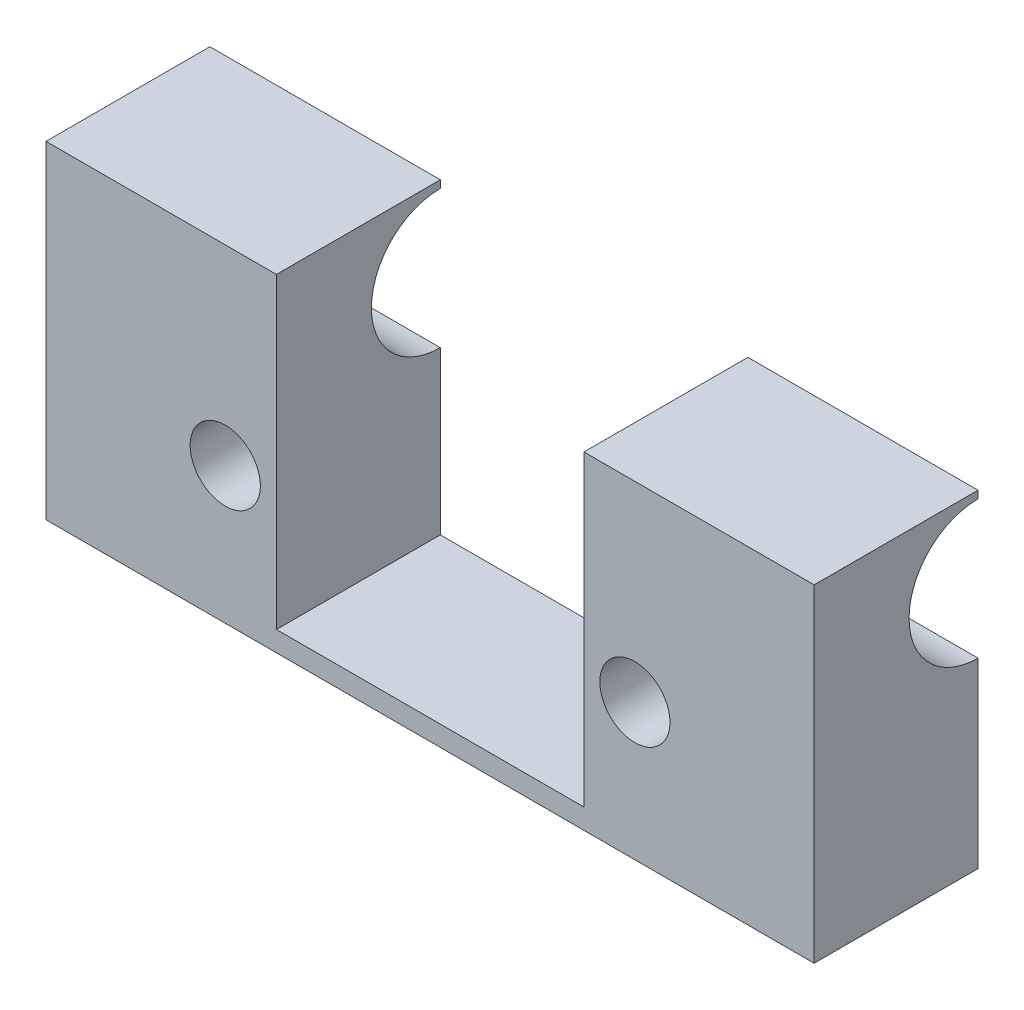
ISO-10303-21;
HEADER;
FILE_DESCRIPTION(('STEP AP214'),'2;1');
FILE_NAME('part.step','',(''),(''),'','','');
FILE_SCHEMA(('AUTOMOTIVE_DESIGN { 1 0 10303 214 1 1 1 1 }'));
ENDSEC;
DATA;
#1=APPLICATION_CONTEXT('core data for automotive mechanical design processes');
#2=APPLICATION_PROTOCOL_DEFINITION('international standard','automotive_design',2000,#1);
#3=PRODUCT_CONTEXT('',#1,'mechanical');
#4=PRODUCT('Part','Part','',(#3));
#5=PRODUCT_RELATED_PRODUCT_CATEGORY('part','',(#4));
#6=PRODUCT_DEFINITION_FORMATION('','',#4);
#7=PRODUCT_DEFINITION_CONTEXT('part definition',#1,'design');
#8=PRODUCT_DEFINITION('design','',#6,#7);
#9=PRODUCT_DEFINITION_SHAPE('','',#8);
#10=(LENGTH_UNIT() NAMED_UNIT(*) SI_UNIT(.MILLI.,.METRE.));
#11=(NAMED_UNIT(*) PLANE_ANGLE_UNIT() SI_UNIT($,.RADIAN.));
#12=(NAMED_UNIT(*) SI_UNIT($,.STERADIAN.) SOLID_ANGLE_UNIT());
#13=UNCERTAINTY_MEASURE_WITH_UNIT(LENGTH_MEASURE(1.E-05),#10,'distance_accuracy_value','');
#14=(GEOMETRIC_REPRESENTATION_CONTEXT(3) GLOBAL_UNCERTAINTY_ASSIGNED_CONTEXT((#13)) GLOBAL_UNIT_ASSIGNED_CONTEXT((#10,
#11,#12)) REPRESENTATION_CONTEXT('',''));
#15=CARTESIAN_POINT('',(0.,0.,0.));
#16=DIRECTION('',(0.,0.,1.));
#17=DIRECTION('',(1.,0.,0.));
#18=AXIS2_PLACEMENT_3D('',#15,#16,#17);
#19=CARTESIAN_POINT('',(0.,0.,0.));
#20=DIRECTION('',(0.,0.,1.));
#21=DIRECTION('',(1.,0.,0.));
#22=AXIS2_PLACEMENT_3D('',#19,#20,#21);
#23=PLANE('',#22);
#24=DIRECTION('',(0.,-1.,0.));
#25=VECTOR('',#24,1.);
#26=CARTESIAN_POINT('',(35.71875,0.,0.));
#27=LINE('',#26,#25);
#28=CARTESIAN_POINT('',(35.71875,30.48,0.));
#29=VERTEX_POINT('',#28);
#30=CARTESIAN_POINT('',(35.71875,29.7794062900681,0.));
#31=VERTEX_POINT('',#30);
#32=EDGE_CURVE('E193',#29,#31,#27,.T.);
#33=ORIENTED_EDGE('',*,*,#32,.T.);
#34=DIRECTION('',(1.,0.,0.));
#35=VECTOR('',#34,1.);
#36=CARTESIAN_POINT('',(-38.4492499999999,29.7794062900681,0.));
#37=LINE('',#36,#35);
#38=CARTESIAN_POINT('',(14.3129,29.7794062900681,0.));
#39=VERTEX_POINT('',#38);
#40=EDGE_CURVE('E207',#39,#31,#37,.T.);
#41=ORIENTED_EDGE('',*,*,#40,.F.);
#42=DIRECTION('',(0.,-1.,0.));
#43=VECTOR('',#42,1.);
#44=CARTESIAN_POINT('',(14.3129,30.48,0.));
#45=LINE('',#44,#43);
#46=CARTESIAN_POINT('',(14.3129,30.48,0.));
#47=VERTEX_POINT('',#46);
#48=EDGE_CURVE('E209',#47,#39,#45,.T.);
#49=ORIENTED_EDGE('',*,*,#48,.F.);
#50=DIRECTION('',(-1.,0.,0.));
#51=VECTOR('',#50,1.);
#52=CARTESIAN_POINT('',(0.,30.48,0.));
#53=LINE('',#52,#51);
#54=EDGE_CURVE('E39',#29,#47,#53,.T.);
#55=ORIENTED_EDGE('',*,*,#54,.F.);
#56=EDGE_LOOP('',(#33,#41,#49,#55));
#57=FACE_BOUND('',#56,.T.);
#58=ADVANCED_FACE('F36',(#57),#23,.F.);
#59=DIRECTION('',(0.,1.,0.));
#60=VECTOR('',#59,1.);
#61=CARTESIAN_POINT('',(-14.2875,30.48,0.));
#62=LINE('',#61,#60);
#63=CARTESIAN_POINT('',(-14.2875,29.7794062900681,0.));
#64=VERTEX_POINT('',#63);
#65=CARTESIAN_POINT('',(-14.2875,30.48,0.));
#66=VERTEX_POINT('',#65);
#67=EDGE_CURVE('E201',#64,#66,#62,.T.);
#68=ORIENTED_EDGE('',*,*,#67,.F.);
#69=DIRECTION('',(1.,0.,0.));
#70=VECTOR('',#69,1.);
#71=CARTESIAN_POINT('',(-38.4492499999999,29.7794062900681,0.));
#72=LINE('',#71,#70);
#73=CARTESIAN_POINT('',(-35.71875,29.7794062900681,0.));
#74=VERTEX_POINT('',#73);
#75=EDGE_CURVE('E196',#74,#64,#72,.T.);
#76=ORIENTED_EDGE('',*,*,#75,.F.);
#77=DIRECTION('',(0.,-1.,0.));
#78=VECTOR('',#77,1.);
#79=CARTESIAN_POINT('',(-35.71875,30.48,0.));
#80=LINE('',#79,#78);
#81=CARTESIAN_POINT('',(-35.71875,30.48,0.));
#82=VERTEX_POINT('',#81);
#83=EDGE_CURVE('E202',#82,#74,#80,.T.);
#84=ORIENTED_EDGE('',*,*,#83,.F.);
#85=DIRECTION('',(-1.,0.,0.));
#86=VECTOR('',#85,1.);
#87=CARTESIAN_POINT('',(0.,30.48,0.));
#88=LINE('',#87,#86);
#89=EDGE_CURVE('E204',#66,#82,#88,.T.);
#90=ORIENTED_EDGE('',*,*,#89,.F.);
#91=EDGE_LOOP('',(#68,#76,#84,#90));
#92=FACE_BOUND('',#91,.T.);
#93=ADVANCED_FACE('F259',(#92),#23,.F.);
#94=CARTESIAN_POINT('',(-19.05,12.7,0.));
#95=DIRECTION('',(0.,0.,1.));
#96=DIRECTION('',(1.,0.,0.));
#97=AXIS2_PLACEMENT_3D('',#94,#95,#96);
#98=CIRCLE('',#97,3.26389999999999);
#99=CARTESIAN_POINT('',(-15.7861,12.7,0.));
#100=VERTEX_POINT('',#99);
#101=EDGE_CURVE('E191',#100,#100,#98,.F.);
#102=ORIENTED_EDGE('',*,*,#101,.F.);
#103=EDGE_LOOP('',(#102));
#104=FACE_BOUND('',#103,.T.);
#105=CARTESIAN_POINT('',(19.05,12.7,0.));
#106=DIRECTION('',(0.,0.,1.));
#107=DIRECTION('',(1.,0.,0.));
#108=AXIS2_PLACEMENT_3D('',#105,#106,#107);
#109=CIRCLE('',#108,3.26389999999999);
#110=CARTESIAN_POINT('',(22.3139,12.7,0.));
#111=VERTEX_POINT('',#110);
#112=EDGE_CURVE('E183',#111,#111,#109,.F.);
#113=ORIENTED_EDGE('',*,*,#112,.F.);
#114=EDGE_LOOP('',(#113));
#115=FACE_BOUND('',#114,.T.);
#116=CARTESIAN_POINT('',(35.71875,16.9565937099319,0.));
#117=VERTEX_POINT('',#116);
#118=CARTESIAN_POINT('',(35.71875,0.,0.));
#119=VERTEX_POINT('',#118);
#120=EDGE_CURVE('E44',#117,#119,#27,.T.);
#121=ORIENTED_EDGE('',*,*,#120,.T.);
#122=DIRECTION('',(-1.,0.,0.));
#123=VECTOR('',#122,1.);
#124=CARTESIAN_POINT('',(0.,0.,0.));
#125=LINE('',#124,#123);
#126=CARTESIAN_POINT('',(-35.71875,0.,0.));
#127=VERTEX_POINT('',#126);
#128=EDGE_CURVE('E11',#119,#127,#125,.T.);
#129=ORIENTED_EDGE('',*,*,#128,.T.);
#130=CARTESIAN_POINT('',(-35.71875,16.9565937099319,0.));
#131=VERTEX_POINT('',#130);
#132=EDGE_CURVE('E58',#131,#127,#80,.T.);
#133=ORIENTED_EDGE('',*,*,#132,.F.);
#134=DIRECTION('',(1.,0.,0.));
#135=VECTOR('',#134,1.);
#136=CARTESIAN_POINT('',(-38.4492499999999,16.9565937099319,0.));
#137=LINE('',#136,#135);
#138=CARTESIAN_POINT('',(-14.2875,16.9565937099319,0.));
#139=VERTEX_POINT('',#138);
#140=EDGE_CURVE('E198',#139,#131,#137,.F.);
#141=ORIENTED_EDGE('',*,*,#140,.F.);
#142=CARTESIAN_POINT('',(-14.2875,1.8796,0.));
#143=VERTEX_POINT('',#142);
#144=EDGE_CURVE('E199',#143,#139,#62,.T.);
#145=ORIENTED_EDGE('',*,*,#144,.F.);
#146=DIRECTION('',(-1.,0.,0.));
#147=VECTOR('',#146,1.);
#148=CARTESIAN_POINT('',(-14.2875,1.8796,0.));
#149=LINE('',#148,#147);
#150=CARTESIAN_POINT('',(14.3129,1.8796,0.));
#151=VERTEX_POINT('',#150);
#152=EDGE_CURVE('E134',#151,#143,#149,.T.);
#153=ORIENTED_EDGE('',*,*,#152,.F.);
#154=CARTESIAN_POINT('',(14.3129,16.9565937099319,0.));
#155=VERTEX_POINT('',#154);
#156=EDGE_CURVE('E210',#155,#151,#45,.T.);
#157=ORIENTED_EDGE('',*,*,#156,.F.);
#158=DIRECTION('',(1.,0.,0.));
#159=VECTOR('',#158,1.);
#160=CARTESIAN_POINT('',(-38.4492499999999,16.9565937099319,0.));
#161=LINE('',#160,#159);
#162=EDGE_CURVE('E212',#117,#155,#161,.F.);
#163=ORIENTED_EDGE('',*,*,#162,.F.);
#164=EDGE_LOOP('',(#121,#129,#133,#141,#145,#153,#157,#163));
#165=FACE_BOUND('',#164,.T.);
#166=ADVANCED_FACE('F246',(#104,#115,#165),#23,.F.);
#167=CARTESIAN_POINT('',(0.,30.48,0.));
#168=DIRECTION('',(0.,-1.,0.));
#169=DIRECTION('',(0.,0.,-1.));
#170=AXIS2_PLACEMENT_3D('',#167,#168,#169);
#171=PLANE('',#170);
#172=DIRECTION('',(0.,0.,-1.));
#173=VECTOR('',#172,1.);
#174=CARTESIAN_POINT('',(-14.2875,30.48,0.));
#175=LINE('',#174,#173);
#176=CARTESIAN_POINT('',(-14.2875,30.48,15.24));
#177=VERTEX_POINT('',#176);
#178=EDGE_CURVE('E145',#177,#66,#175,.T.);
#179=ORIENTED_EDGE('',*,*,#178,.T.);
#180=ORIENTED_EDGE('',*,*,#89,.T.);
#181=DIRECTION('',(0.,0.,1.));
#182=VECTOR('',#181,1.);
#183=CARTESIAN_POINT('',(-35.71875,30.48,15.24));
#184=LINE('',#183,#182);
#185=CARTESIAN_POINT('',(-35.71875,30.48,15.24));
#186=VERTEX_POINT('',#185);
#187=EDGE_CURVE('E163',#82,#186,#184,.T.);
#188=ORIENTED_EDGE('',*,*,#187,.T.);
#189=DIRECTION('',(1.,0.,0.));
#190=VECTOR('',#189,1.);
#191=CARTESIAN_POINT('',(-35.71875,30.48,15.24));
#192=LINE('',#191,#190);
#193=EDGE_CURVE('E167',#186,#177,#192,.T.);
#194=ORIENTED_EDGE('',*,*,#193,.T.);
#195=EDGE_LOOP('',(#179,#180,#188,#194));
#196=FACE_BOUND('',#195,.T.);
#197=ADVANCED_FACE('F257',(#196),#171,.F.);
#198=CARTESIAN_POINT('',(-35.71875,30.48,15.24));
#199=DIRECTION('',(0.,0.,-1.));
#200=DIRECTION('',(-1.,0.,0.));
#201=AXIS2_PLACEMENT_3D('',#198,#199,#200);
#202=PLANE('',#201);
#203=CARTESIAN_POINT('',(19.05,12.7,15.24));
#204=DIRECTION('',(0.,0.,-1.));
#205=DIRECTION('',(-1.,0.,0.));
#206=AXIS2_PLACEMENT_3D('',#203,#204,#205);
#207=CIRCLE('',#206,3.26389999999999);
#208=CARTESIAN_POINT('',(15.7861,12.7,15.24));
#209=VERTEX_POINT('',#208);
#210=EDGE_CURVE('E230',#209,#209,#207,.T.);
#211=ORIENTED_EDGE('',*,*,#210,.T.);
#212=EDGE_LOOP('',(#211));
#213=FACE_BOUND('',#212,.T.);
#214=CARTESIAN_POINT('',(-19.05,12.7,15.24));
#215=DIRECTION('',(0.,0.,-1.));
#216=DIRECTION('',(-1.,0.,0.));
#217=AXIS2_PLACEMENT_3D('',#214,#215,#216);
#218=CIRCLE('',#217,3.26389999999999);
#219=CARTESIAN_POINT('',(-22.3139,12.7,15.24));
#220=VERTEX_POINT('',#219);
#221=EDGE_CURVE('E227',#220,#220,#218,.T.);
#222=ORIENTED_EDGE('',*,*,#221,.T.);
#223=EDGE_LOOP('',(#222));
#224=FACE_BOUND('',#223,.T.);
#225=DIRECTION('',(1.,0.,0.));
#226=VECTOR('',#225,1.);
#227=CARTESIAN_POINT('',(-14.2875,1.8796,15.24));
#228=LINE('',#227,#226);
#229=CARTESIAN_POINT('',(-14.2875,1.8796,15.24));
#230=VERTEX_POINT('',#229);
#231=CARTESIAN_POINT('',(14.3129,1.8796,15.24));
#232=VERTEX_POINT('',#231);
#233=EDGE_CURVE('E131',#230,#232,#228,.T.);
#234=ORIENTED_EDGE('',*,*,#233,.F.);
#235=DIRECTION('',(0.,-1.,0.));
#236=VECTOR('',#235,1.);
#237=CARTESIAN_POINT('',(-14.2875,30.48,15.24));
#238=LINE('',#237,#236);
#239=EDGE_CURVE('E141',#177,#230,#238,.T.);
#240=ORIENTED_EDGE('',*,*,#239,.F.);
#241=ORIENTED_EDGE('',*,*,#193,.F.);
#242=DIRECTION('',(0.,-1.,0.));
#243=VECTOR('',#242,1.);
#244=CARTESIAN_POINT('',(-35.71875,30.48,15.24));
#245=LINE('',#244,#243);
#246=CARTESIAN_POINT('',(-35.71875,0.,15.24));
#247=VERTEX_POINT('',#246);
#248=EDGE_CURVE('E177',#186,#247,#245,.T.);
#249=ORIENTED_EDGE('',*,*,#248,.T.);
#250=DIRECTION('',(1.,0.,0.));
#251=VECTOR('',#250,1.);
#252=CARTESIAN_POINT('',(-35.71875,0.,15.24));
#253=LINE('',#252,#251);
#254=CARTESIAN_POINT('',(35.71875,0.,15.24));
#255=VERTEX_POINT('',#254);
#256=EDGE_CURVE('E164',#247,#255,#253,.T.);
#257=ORIENTED_EDGE('',*,*,#256,.T.);
#258=DIRECTION('',(0.,-1.,0.));
#259=VECTOR('',#258,1.);
#260=CARTESIAN_POINT('',(35.71875,30.48,15.24));
#261=LINE('',#260,#259);
#262=CARTESIAN_POINT('',(35.71875,30.48,15.24));
#263=VERTEX_POINT('',#262);
#264=EDGE_CURVE('E169',#263,#255,#261,.T.);
#265=ORIENTED_EDGE('',*,*,#264,.F.);
#266=CARTESIAN_POINT('',(14.3129,30.48,15.24));
#267=VERTEX_POINT('',#266);
#268=EDGE_CURVE('E166',#267,#263,#192,.T.);
#269=ORIENTED_EDGE('',*,*,#268,.F.);
#270=DIRECTION('',(0.,1.,0.));
#271=VECTOR('',#270,1.);
#272=CARTESIAN_POINT('',(14.3129,30.48,15.24));
#273=LINE('',#272,#271);
#274=EDGE_CURVE('E138',#232,#267,#273,.T.);
#275=ORIENTED_EDGE('',*,*,#274,.F.);
#276=EDGE_LOOP('',(#234,#240,#241,#249,#257,#265,#269,#275));
#277=FACE_BOUND('',#276,.T.);
#278=ADVANCED_FACE('F151',(#213,#224,#277),#202,.F.);
#279=CARTESIAN_POINT('',(19.05,12.7,-15.24));
#280=DIRECTION('',(0.,0.,-1.));
#281=DIRECTION('',(-1.,0.,0.));
#282=AXIS2_PLACEMENT_3D('',#279,#280,#281);
#283=CYLINDRICAL_SURFACE('',#282,3.26389999999999);
#284=ORIENTED_EDGE('',*,*,#112,.T.);
#285=EDGE_LOOP('',(#284));
#286=FACE_BOUND('',#285,.T.);
#287=ORIENTED_EDGE('',*,*,#210,.F.);
#288=EDGE_LOOP('',(#287));
#289=FACE_BOUND('',#288,.T.);
#290=ADVANCED_FACE('F296',(#286,#289),#283,.F.);
#291=CARTESIAN_POINT('',(-19.05,12.7,-15.24));
#292=DIRECTION('',(0.,0.,-1.));
#293=DIRECTION('',(-1.,0.,0.));
#294=AXIS2_PLACEMENT_3D('',#291,#292,#293);
#295=CYLINDRICAL_SURFACE('',#294,3.26389999999999);
#296=ORIENTED_EDGE('',*,*,#101,.T.);
#297=EDGE_LOOP('',(#296));
#298=FACE_BOUND('',#297,.T.);
#299=ORIENTED_EDGE('',*,*,#221,.F.);
#300=EDGE_LOOP('',(#299));
#301=FACE_BOUND('',#300,.T.);
#302=ADVANCED_FACE('F306',(#298,#301),#295,.F.);
#303=CARTESIAN_POINT('',(-14.2875,1.8796,-16.256));
#304=DIRECTION('',(0.,-1.,0.));
#305=DIRECTION('',(0.,0.,-1.));
#306=AXIS2_PLACEMENT_3D('',#303,#304,#305);
#307=PLANE('',#306);
#308=DIRECTION('',(0.,0.,1.));
#309=VECTOR('',#308,1.);
#310=CARTESIAN_POINT('',(14.3129,1.8796,-16.256));
#311=LINE('',#310,#309);
#312=EDGE_CURVE('E137',#151,#232,#311,.T.);
#313=ORIENTED_EDGE('',*,*,#312,.F.);
#314=ORIENTED_EDGE('',*,*,#152,.T.);
#315=DIRECTION('',(0.,0.,1.));
#316=VECTOR('',#315,1.);
#317=CARTESIAN_POINT('',(-14.2875,1.8796,-16.256));
#318=LINE('',#317,#316);
#319=EDGE_CURVE('E126',#143,#230,#318,.T.);
#320=ORIENTED_EDGE('',*,*,#319,.T.);
#321=ORIENTED_EDGE('',*,*,#233,.T.);
#322=EDGE_LOOP('',(#313,#314,#320,#321));
#323=FACE_BOUND('',#322,.T.);
#324=ADVANCED_FACE('F129',(#323),#307,.F.);
#325=DIRECTION('',(0.,0.,-1.));
#326=VECTOR('',#325,1.);
#327=CARTESIAN_POINT('',(35.71875,30.48,15.24));
#328=LINE('',#327,#326);
#329=EDGE_CURVE('E160',#263,#29,#328,.T.);
#330=ORIENTED_EDGE('',*,*,#329,.T.);
#331=ORIENTED_EDGE('',*,*,#54,.T.);
#332=DIRECTION('',(0.,0.,1.));
#333=VECTOR('',#332,1.);
#334=CARTESIAN_POINT('',(14.3129,30.48,0.));
#335=LINE('',#334,#333);
#336=EDGE_CURVE('E180',#47,#267,#335,.T.);
#337=ORIENTED_EDGE('',*,*,#336,.T.);
#338=ORIENTED_EDGE('',*,*,#268,.T.);
#339=EDGE_LOOP('',(#330,#331,#337,#338));
#340=FACE_BOUND('',#339,.T.);
#341=ADVANCED_FACE('F248',(#340),#171,.F.);
#342=CARTESIAN_POINT('',(14.3129,30.48,-16.256));
#343=DIRECTION('',(1.,0.,0.));
#344=DIRECTION('',(0.,1.,0.));
#345=AXIS2_PLACEMENT_3D('',#342,#343,#344);
#346=PLANE('',#345);
#347=ORIENTED_EDGE('',*,*,#336,.F.);
#348=ORIENTED_EDGE('',*,*,#48,.T.);
#349=CARTESIAN_POINT('',(14.3129,23.368,0.));
#350=DIRECTION('',(1.,0.,0.));
#351=DIRECTION('',(0.,1.,0.));
#352=AXIS2_PLACEMENT_3D('',#349,#350,#351);
#353=CIRCLE('',#352,6.4114062900681);
#354=EDGE_CURVE('E184',#39,#155,#353,.T.);
#355=ORIENTED_EDGE('',*,*,#354,.T.);
#356=ORIENTED_EDGE('',*,*,#156,.T.);
#357=ORIENTED_EDGE('',*,*,#312,.T.);
#358=ORIENTED_EDGE('',*,*,#274,.T.);
#359=EDGE_LOOP('',(#347,#348,#355,#356,#357,#358));
#360=FACE_BOUND('',#359,.T.);
#361=ADVANCED_FACE('F251',(#360),#346,.F.);
#362=CARTESIAN_POINT('',(-38.4492499999999,23.368,0.));
#363=DIRECTION('',(1.,0.,0.));
#364=DIRECTION('',(0.,0.,-1.));
#365=AXIS2_PLACEMENT_3D('',#362,#363,#364);
#366=CYLINDRICAL_SURFACE('',#365,6.4114062900681);
#367=CARTESIAN_POINT('',(35.71875,23.368,0.));
#368=DIRECTION('',(1.,0.,0.));
#369=DIRECTION('',(0.,0.,-1.));
#370=AXIS2_PLACEMENT_3D('',#367,#368,#369);
#371=CIRCLE('',#370,6.4114062900681);
#372=EDGE_CURVE('E188',#31,#117,#371,.T.);
#373=ORIENTED_EDGE('',*,*,#372,.T.);
#374=ORIENTED_EDGE('',*,*,#162,.T.);
#375=ORIENTED_EDGE('',*,*,#354,.F.);
#376=ORIENTED_EDGE('',*,*,#40,.T.);
#377=EDGE_LOOP('',(#373,#374,#375,#376));
#378=FACE_BOUND('',#377,.T.);
#379=ADVANCED_FACE('F218',(#378),#366,.F.);
#380=CARTESIAN_POINT('',(-35.71875,30.48,15.24));
#381=DIRECTION('',(1.,0.,0.));
#382=DIRECTION('',(0.,0.,-1.));
#383=AXIS2_PLACEMENT_3D('',#380,#381,#382);
#384=PLANE('',#383);
#385=ORIENTED_EDGE('',*,*,#187,.F.);
#386=ORIENTED_EDGE('',*,*,#83,.T.);
#387=CARTESIAN_POINT('',(-35.71875,23.368,0.));
#388=DIRECTION('',(1.,0.,0.));
#389=DIRECTION('',(0.,0.,-1.));
#390=AXIS2_PLACEMENT_3D('',#387,#388,#389);
#391=CIRCLE('',#390,6.4114062900681);
#392=EDGE_CURVE('E149',#74,#131,#391,.T.);
#393=ORIENTED_EDGE('',*,*,#392,.T.);
#394=ORIENTED_EDGE('',*,*,#132,.T.);
#395=DIRECTION('',(0.,0.,1.));
#396=VECTOR('',#395,1.);
#397=CARTESIAN_POINT('',(-35.71875,0.,15.24));
#398=LINE('',#397,#396);
#399=EDGE_CURVE('E172',#127,#247,#398,.T.);
#400=ORIENTED_EDGE('',*,*,#399,.T.);
#401=ORIENTED_EDGE('',*,*,#248,.F.);
#402=EDGE_LOOP('',(#385,#386,#393,#394,#400,#401));
#403=FACE_BOUND('',#402,.T.);
#404=ADVANCED_FACE('F237',(#403),#384,.F.);
#405=CARTESIAN_POINT('',(-14.2875,30.48,-16.256));
#406=DIRECTION('',(-1.,0.,0.));
#407=DIRECTION('',(0.,-1.,0.));
#408=AXIS2_PLACEMENT_3D('',#405,#406,#407);
#409=PLANE('',#408);
#410=ORIENTED_EDGE('',*,*,#319,.F.);
#411=ORIENTED_EDGE('',*,*,#144,.T.);
#412=CARTESIAN_POINT('',(-14.2875,23.368,0.));
#413=DIRECTION('',(-1.,0.,0.));
#414=DIRECTION('',(0.,-1.,0.));
#415=AXIS2_PLACEMENT_3D('',#412,#413,#414);
#416=CIRCLE('',#415,6.4114062900681);
#417=EDGE_CURVE('E187',#139,#64,#416,.T.);
#418=ORIENTED_EDGE('',*,*,#417,.T.);
#419=ORIENTED_EDGE('',*,*,#67,.T.);
#420=ORIENTED_EDGE('',*,*,#178,.F.);
#421=ORIENTED_EDGE('',*,*,#239,.T.);
#422=EDGE_LOOP('',(#410,#411,#418,#419,#420,#421));
#423=FACE_BOUND('',#422,.T.);
#424=ADVANCED_FACE('F142',(#423),#409,.F.);
#425=ORIENTED_EDGE('',*,*,#417,.F.);
#426=ORIENTED_EDGE('',*,*,#140,.T.);
#427=ORIENTED_EDGE('',*,*,#392,.F.);
#428=ORIENTED_EDGE('',*,*,#75,.T.);
#429=EDGE_LOOP('',(#425,#426,#427,#428));
#430=FACE_BOUND('',#429,.T.);
#431=ADVANCED_FACE('F242',(#430),#366,.F.);
#432=CARTESIAN_POINT('',(0.,0.,0.));
#433=DIRECTION('',(0.,-1.,0.));
#434=DIRECTION('',(0.,0.,-1.));
#435=AXIS2_PLACEMENT_3D('',#432,#433,#434);
#436=PLANE('',#435);
#437=ORIENTED_EDGE('',*,*,#128,.F.);
#438=DIRECTION('',(0.,0.,-1.));
#439=VECTOR('',#438,1.);
#440=CARTESIAN_POINT('',(35.71875,0.,15.24));
#441=LINE('',#440,#439);
#442=EDGE_CURVE('E158',#255,#119,#441,.T.);
#443=ORIENTED_EDGE('',*,*,#442,.F.);
#444=ORIENTED_EDGE('',*,*,#256,.F.);
#445=ORIENTED_EDGE('',*,*,#399,.F.);
#446=EDGE_LOOP('',(#437,#443,#444,#445));
#447=FACE_BOUND('',#446,.T.);
#448=ADVANCED_FACE('F254',(#447),#436,.T.);
#449=CARTESIAN_POINT('',(35.71875,30.48,15.24));
#450=DIRECTION('',(-1.,0.,0.));
#451=DIRECTION('',(0.,0.,1.));
#452=AXIS2_PLACEMENT_3D('',#449,#450,#451);
#453=PLANE('',#452);
#454=ORIENTED_EDGE('',*,*,#32,.F.);
#455=ORIENTED_EDGE('',*,*,#329,.F.);
#456=ORIENTED_EDGE('',*,*,#264,.T.);
#457=ORIENTED_EDGE('',*,*,#442,.T.);
#458=ORIENTED_EDGE('',*,*,#120,.F.);
#459=ORIENTED_EDGE('',*,*,#372,.F.);
#460=EDGE_LOOP('',(#454,#455,#456,#457,#458,#459));
#461=FACE_BOUND('',#460,.T.);
#462=ADVANCED_FACE('F226',(#461),#453,.F.);
#463=CLOSED_SHELL('',(#58,#93,#166,#197,#278,#290,#302,#324,#341,#361,#379,#404,#424,#431,#448,#462));
#464=MANIFOLD_SOLID_BREP('B2',#463);
#465=ADVANCED_BREP_SHAPE_REPRESENTATION('',(#18,#464),#14);
#466=SHAPE_DEFINITION_REPRESENTATION(#9,#465);
ENDSEC;
END-ISO-10303-21;
